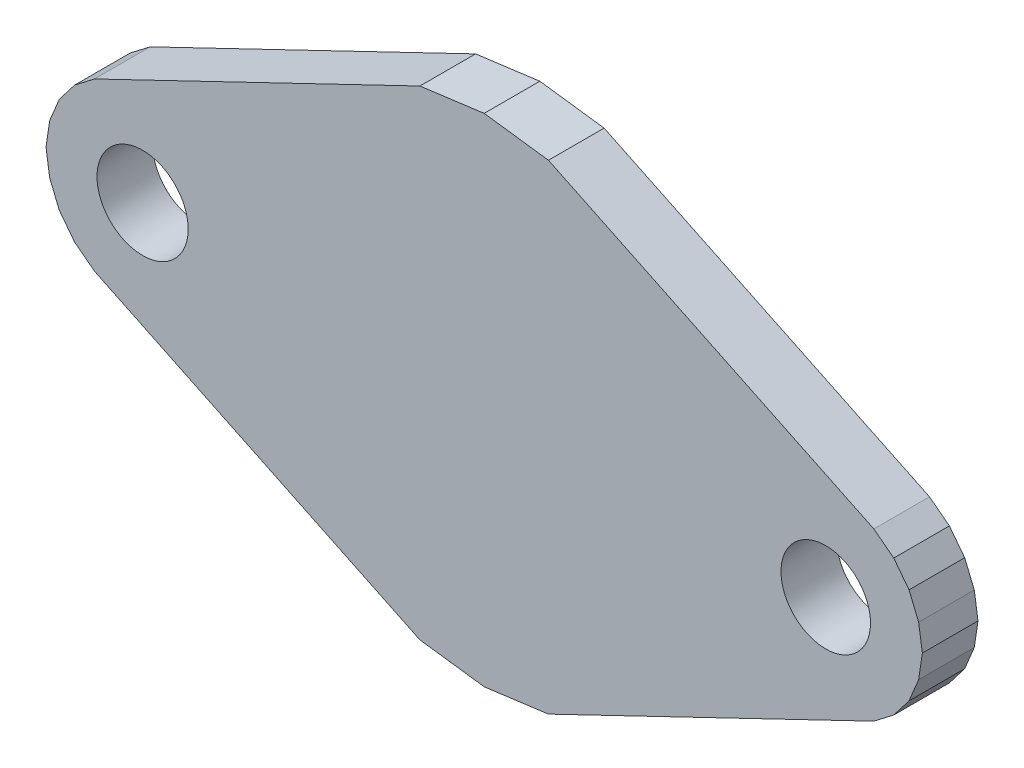
ISO-10303-21;
HEADER;
FILE_DESCRIPTION(('STEP AP214'),'2;1');
FILE_NAME('part.step','',(''),(''),'','','');
FILE_SCHEMA(('AUTOMOTIVE_DESIGN { 1 0 10303 214 1 1 1 1 }'));
ENDSEC;
DATA;
#1=APPLICATION_CONTEXT('core data for automotive mechanical design processes');
#2=APPLICATION_PROTOCOL_DEFINITION('international standard','automotive_design',2000,#1);
#3=PRODUCT_CONTEXT('',#1,'mechanical');
#4=PRODUCT('Part','Part','',(#3));
#5=PRODUCT_RELATED_PRODUCT_CATEGORY('part','',(#4));
#6=PRODUCT_DEFINITION_FORMATION('','',#4);
#7=PRODUCT_DEFINITION_CONTEXT('part definition',#1,'design');
#8=PRODUCT_DEFINITION('design','',#6,#7);
#9=PRODUCT_DEFINITION_SHAPE('','',#8);
#10=(LENGTH_UNIT() NAMED_UNIT(*) SI_UNIT(.MILLI.,.METRE.));
#11=(NAMED_UNIT(*) PLANE_ANGLE_UNIT() SI_UNIT($,.RADIAN.));
#12=(NAMED_UNIT(*) SI_UNIT($,.STERADIAN.) SOLID_ANGLE_UNIT());
#13=UNCERTAINTY_MEASURE_WITH_UNIT(LENGTH_MEASURE(1.E-05),#10,'distance_accuracy_value','');
#14=(GEOMETRIC_REPRESENTATION_CONTEXT(3) GLOBAL_UNCERTAINTY_ASSIGNED_CONTEXT((#13)) GLOBAL_UNIT_ASSIGNED_CONTEXT((#10,
#11,#12)) REPRESENTATION_CONTEXT('',''));
#15=CARTESIAN_POINT('',(0.,0.,0.));
#16=DIRECTION('',(0.,0.,1.));
#17=DIRECTION('',(1.,0.,0.));
#18=AXIS2_PLACEMENT_3D('',#15,#16,#17);
#19=CARTESIAN_POINT('',(-0.726920364105193,5.52151047865007,3.));
#20=DIRECTION('',(-0.130526142647191,0.9914448679002,0.));
#21=DIRECTION('',(-0.9914448679002,-0.130526142647191,0.));
#22=AXIS2_PLACEMENT_3D('',#19,#20,#21);
#23=PLANE('',#22);
#24=DIRECTION('',(0.9914448679002,0.130526142647191,0.));
#25=VECTOR('',#24,1.);
#26=CARTESIAN_POINT('',(-0.726920364105193,5.52151047865007,0.));
#27=LINE('',#26,#25);
#28=CARTESIAN_POINT('',(-3.44087929403345,5.16421114522703,0.));
#29=VERTEX_POINT('',#28);
#30=CARTESIAN_POINT('',(0.0236220005899665,5.62032121732931,0.));
#31=VERTEX_POINT('',#30);
#32=EDGE_CURVE('E246',#29,#31,#27,.T.);
#33=ORIENTED_EDGE('',*,*,#32,.F.);
#34=DIRECTION('',(0.,0.,-1.));
#35=VECTOR('',#34,1.);
#36=CARTESIAN_POINT('',(-3.44087929403345,5.16421114522703,3.));
#37=LINE('',#36,#35);
#38=CARTESIAN_POINT('',(-3.44087929403345,5.16421114522703,3.));
#39=VERTEX_POINT('',#38);
#40=EDGE_CURVE('E11',#39,#29,#37,.T.);
#41=ORIENTED_EDGE('',*,*,#40,.F.);
#42=DIRECTION('',(0.9914448679002,0.130526142647191,0.));
#43=VECTOR('',#42,1.);
#44=CARTESIAN_POINT('',(-0.726920364105193,5.52151047865007,3.));
#45=LINE('',#44,#43);
#46=CARTESIAN_POINT('',(0.0236220005899665,5.62032121732931,3.));
#47=VERTEX_POINT('',#46);
#48=EDGE_CURVE('E527',#39,#47,#45,.T.);
#49=ORIENTED_EDGE('',*,*,#48,.T.);
#50=DIRECTION('',(0.,0.,-1.));
#51=VECTOR('',#50,1.);
#52=CARTESIAN_POINT('',(0.0236220005899665,5.62032121732931,3.));
#53=LINE('',#52,#51);
#54=EDGE_CURVE('E59',#47,#31,#53,.T.);
#55=ORIENTED_EDGE('',*,*,#54,.T.);
#56=EDGE_LOOP('',(#33,#41,#49,#55));
#57=FACE_BOUND('',#56,.T.);
#58=ADVANCED_FACE('F41',(#57),#23,.T.);
#59=CARTESIAN_POINT('',(-2.66467167889706,5.53771170962161,3.));
#60=DIRECTION('',(0.433599763460749,-0.901105568247574,0.));
#61=DIRECTION('',(0.901105568247574,0.433599763460749,0.));
#62=AXIS2_PLACEMENT_3D('',#59,#60,#61);
#63=PLANE('',#62);
#64=DIRECTION('',(-0.901105568247574,-0.433599763460749,0.));
#65=VECTOR('',#64,1.);
#66=CARTESIAN_POINT('',(-2.66467167889706,5.53771170962161,0.));
#67=LINE('',#66,#65);
#68=CARTESIAN_POINT('',(-20.9829270094633,-3.27678401455183,0.));
#69=VERTEX_POINT('',#68);
#70=EDGE_CURVE('E249',#29,#69,#67,.T.);
#71=ORIENTED_EDGE('',*,*,#70,.T.);
#72=DIRECTION('',(0.,0.,-1.));
#73=VECTOR('',#72,1.);
#74=CARTESIAN_POINT('',(-20.9829270094633,-3.27678401455183,3.));
#75=LINE('',#74,#73);
#76=CARTESIAN_POINT('',(-20.9829270094633,-3.27678401455183,3.));
#77=VERTEX_POINT('',#76);
#78=EDGE_CURVE('E51',#77,#69,#75,.T.);
#79=ORIENTED_EDGE('',*,*,#78,.F.);
#80=DIRECTION('',(-0.901105568247574,-0.433599763460749,0.));
#81=VECTOR('',#80,1.);
#82=CARTESIAN_POINT('',(-2.66467167889706,5.53771170962161,3.));
#83=LINE('',#82,#81);
#84=EDGE_CURVE('E530',#39,#77,#83,.T.);
#85=ORIENTED_EDGE('',*,*,#84,.F.);
#86=ORIENTED_EDGE('',*,*,#40,.T.);
#87=EDGE_LOOP('',(#71,#79,#85,#86));
#88=FACE_BOUND('',#87,.T.);
#89=ADVANCED_FACE('F421',(#88),#63,.F.);
#90=CARTESIAN_POINT('',(-6.19351671958089,8.07154044731068,3.));
#91=DIRECTION('',(0.60876179399814,-0.79335306022487,0.));
#92=DIRECTION('',(0.79335306022487,0.60876179399814,0.));
#93=AXIS2_PLACEMENT_3D('',#90,#91,#92);
#94=PLANE('',#93);
#95=DIRECTION('',(-0.79335306022487,-0.60876179399814,0.));
#96=VECTOR('',#95,1.);
#97=CARTESIAN_POINT('',(-6.19351671958089,8.07154044731068,0.));
#98=LINE('',#97,#96);
#99=CARTESIAN_POINT('',(-22.0563816325739,-4.10047550186415,0.));
#100=VERTEX_POINT('',#99);
#101=EDGE_CURVE('E253',#69,#100,#98,.T.);
#102=ORIENTED_EDGE('',*,*,#101,.T.);
#103=DIRECTION('',(0.,0.,-1.));
#104=VECTOR('',#103,1.);
#105=CARTESIAN_POINT('',(-22.0563816325739,-4.10047550186415,3.));
#106=LINE('',#105,#104);
#107=CARTESIAN_POINT('',(-22.0563816325739,-4.10047550186415,3.));
#108=VERTEX_POINT('',#107);
#109=EDGE_CURVE('E407',#108,#100,#106,.T.);
#110=ORIENTED_EDGE('',*,*,#109,.F.);
#111=DIRECTION('',(-0.79335306022487,-0.60876179399814,0.));
#112=VECTOR('',#111,1.);
#113=CARTESIAN_POINT('',(-6.19351671958089,8.07154044731068,3.));
#114=LINE('',#113,#112);
#115=EDGE_CURVE('E417',#77,#108,#114,.T.);
#116=ORIENTED_EDGE('',*,*,#115,.F.);
#117=ORIENTED_EDGE('',*,*,#78,.T.);
#118=EDGE_LOOP('',(#102,#110,#116,#117));
#119=FACE_BOUND('',#118,.T.);
#120=ADVANCED_FACE('F414',(#119),#94,.F.);
#121=CARTESIAN_POINT('',(-11.9021104194484,9.13281782627906,3.));
#122=DIRECTION('',(0.793353105686463,-0.60876173475149,0.));
#123=DIRECTION('',(0.60876173475149,0.793353105686463,0.));
#124=AXIS2_PLACEMENT_3D('',#121,#122,#123);
#125=PLANE('',#124);
#126=DIRECTION('',(-0.60876173475149,-0.793353105686463,0.));
#127=VECTOR('',#126,1.);
#128=CARTESIAN_POINT('',(-11.9021104194484,9.13281782627906,0.));
#129=LINE('',#128,#127);
#130=CARTESIAN_POINT('',(-22.8800721885636,-5.17392907723684,0.));
#131=VERTEX_POINT('',#130);
#132=EDGE_CURVE('E257',#100,#131,#129,.T.);
#133=ORIENTED_EDGE('',*,*,#132,.T.);
#134=DIRECTION('',(0.,0.,-1.));
#135=VECTOR('',#134,1.);
#136=CARTESIAN_POINT('',(-22.8800721885636,-5.17392907723684,3.));
#137=LINE('',#136,#135);
#138=CARTESIAN_POINT('',(-22.8800721885636,-5.17392907723684,3.));
#139=VERTEX_POINT('',#138);
#140=EDGE_CURVE('E403',#139,#131,#137,.T.);
#141=ORIENTED_EDGE('',*,*,#140,.F.);
#142=DIRECTION('',(-0.60876173475149,-0.793353105686463,0.));
#143=VECTOR('',#142,1.);
#144=CARTESIAN_POINT('',(-11.9021104194484,9.13281782627906,3.));
#145=LINE('',#144,#143);
#146=EDGE_CURVE('E537',#108,#139,#145,.T.);
#147=ORIENTED_EDGE('',*,*,#146,.F.);
#148=ORIENTED_EDGE('',*,*,#109,.T.);
#149=EDGE_LOOP('',(#133,#141,#147,#148));
#150=FACE_BOUND('',#149,.T.);
#151=ADVANCED_FACE('F433',(#150),#125,.F.);
#152=CARTESIAN_POINT('',(-17.7001064420641,7.33162057234155,3.));
#153=DIRECTION('',(0.923879598418656,-0.382683273250586,0.));
#154=DIRECTION('',(0.382683273250586,0.923879598418656,0.));
#155=AXIS2_PLACEMENT_3D('',#152,#153,#154);
#156=PLANE('',#155);
#157=DIRECTION('',(-0.382683273250586,-0.923879598418657,0.));
#158=VECTOR('',#157,1.);
#159=CARTESIAN_POINT('',(-17.7001064420641,7.33162057234155,0.));
#160=LINE('',#159,#158);
#161=CARTESIAN_POINT('',(-23.3978657849366,-6.42399400904675,0.));
#162=VERTEX_POINT('',#161);
#163=EDGE_CURVE('E261',#131,#162,#160,.T.);
#164=ORIENTED_EDGE('',*,*,#163,.T.);
#165=DIRECTION('',(0.,0.,-1.));
#166=VECTOR('',#165,1.);
#167=CARTESIAN_POINT('',(-23.3978657849366,-6.42399400904675,3.));
#168=LINE('',#167,#166);
#169=CARTESIAN_POINT('',(-23.3978657849366,-6.42399400904675,3.));
#170=VERTEX_POINT('',#169);
#171=EDGE_CURVE('E399',#170,#162,#168,.T.);
#172=ORIENTED_EDGE('',*,*,#171,.F.);
#173=DIRECTION('',(-0.382683273250586,-0.923879598418657,0.));
#174=VECTOR('',#173,1.);
#175=CARTESIAN_POINT('',(-17.7001064420641,7.33162057234155,3.));
#176=LINE('',#175,#174);
#177=EDGE_CURVE('E541',#139,#170,#176,.T.);
#178=ORIENTED_EDGE('',*,*,#177,.F.);
#179=ORIENTED_EDGE('',*,*,#140,.T.);
#180=EDGE_LOOP('',(#164,#172,#178,#179));
#181=FACE_BOUND('',#180,.T.);
#182=ADVANCED_FACE('F436',(#181),#156,.F.);
#183=CARTESIAN_POINT('',(-21.9473291319936,3.28048557899017,3.));
#184=DIRECTION('',(0.989012995845742,-0.14782859685538,0.));
#185=DIRECTION('',(0.14782859685538,0.989012995845742,0.));
#186=AXIS2_PLACEMENT_3D('',#183,#184,#185);
#187=PLANE('',#186);
#188=DIRECTION('',(-0.14782859685538,-0.989012995845742,0.));
#189=VECTOR('',#188,1.);
#190=CARTESIAN_POINT('',(-21.9473291319936,3.28048557899017,0.));
#191=LINE('',#190,#189);
#192=CARTESIAN_POINT('',(-23.5983785893768,-7.76547849610348,0.));
#193=VERTEX_POINT('',#192);
#194=EDGE_CURVE('E265',#162,#193,#191,.T.);
#195=ORIENTED_EDGE('',*,*,#194,.T.);
#196=DIRECTION('',(0.,0.,-1.));
#197=VECTOR('',#196,1.);
#198=CARTESIAN_POINT('',(-23.5983785893768,-7.76547849610348,3.));
#199=LINE('',#198,#197);
#200=CARTESIAN_POINT('',(-23.5983785893768,-7.76547849610348,3.));
#201=VERTEX_POINT('',#200);
#202=EDGE_CURVE('E395',#201,#193,#199,.T.);
#203=ORIENTED_EDGE('',*,*,#202,.F.);
#204=DIRECTION('',(-0.14782859685538,-0.989012995845742,0.));
#205=VECTOR('',#204,1.);
#206=CARTESIAN_POINT('',(-21.9473291319936,3.28048557899017,3.));
#207=LINE('',#206,#205);
#208=EDGE_CURVE('E545',#170,#201,#207,.T.);
#209=ORIENTED_EDGE('',*,*,#208,.F.);
#210=ORIENTED_EDGE('',*,*,#171,.T.);
#211=EDGE_LOOP('',(#195,#203,#209,#210));
#212=FACE_BOUND('',#211,.T.);
#213=ADVANCED_FACE('F440',(#212),#187,.F.);
#214=CARTESIAN_POINT('',(-24.2180234873694,-3.61989067006792,3.));
#215=DIRECTION('',(0.989012980840817,0.147828697242321,0.));
#216=DIRECTION('',(-0.147828697242321,0.989012980840817,0.));
#217=AXIS2_PLACEMENT_3D('',#214,#215,#216);
#218=PLANE('',#217);
#219=DIRECTION('',(0.147828697242321,-0.989012980840817,0.));
#220=VECTOR('',#219,1.);
#221=CARTESIAN_POINT('',(-24.2180234873694,-3.61989067006792,0.));
#222=LINE('',#221,#220);
#223=CARTESIAN_POINT('',(-23.3978657849366,-9.10696205183764,0.));
#224=VERTEX_POINT('',#223);
#225=EDGE_CURVE('E269',#193,#224,#222,.T.);
#226=ORIENTED_EDGE('',*,*,#225,.T.);
#227=DIRECTION('',(0.,0.,-1.));
#228=VECTOR('',#227,1.);
#229=CARTESIAN_POINT('',(-23.3978657849366,-9.10696205183764,3.));
#230=LINE('',#229,#228);
#231=CARTESIAN_POINT('',(-23.3978657849366,-9.10696205183764,3.));
#232=VERTEX_POINT('',#231);
#233=EDGE_CURVE('E391',#232,#224,#230,.T.);
#234=ORIENTED_EDGE('',*,*,#233,.F.);
#235=DIRECTION('',(0.147828697242321,-0.989012980840817,0.));
#236=VECTOR('',#235,1.);
#237=CARTESIAN_POINT('',(-24.2180234873694,-3.61989067006792,3.));
#238=LINE('',#237,#236);
#239=EDGE_CURVE('E549',#201,#232,#238,.T.);
#240=ORIENTED_EDGE('',*,*,#239,.F.);
#241=ORIENTED_EDGE('',*,*,#202,.T.);
#242=EDGE_LOOP('',(#226,#234,#240,#241));
#243=FACE_BOUND('',#242,.T.);
#244=ADVANCED_FACE('F444',(#243),#218,.F.);
#245=CARTESIAN_POINT('',(-23.1911267251698,-9.60607453692842,3.));
#246=DIRECTION('',(0.923879598418656,0.382683273250586,0.));
#247=DIRECTION('',(-0.382683273250586,0.923879598418656,0.));
#248=AXIS2_PLACEMENT_3D('',#245,#246,#247);
#249=PLANE('',#248);
#250=DIRECTION('',(0.382683273250586,-0.923879598418657,0.));
#251=VECTOR('',#250,1.);
#252=CARTESIAN_POINT('',(-23.1911267251698,-9.60607453692842,0.));
#253=LINE('',#252,#251);
#254=CARTESIAN_POINT('',(-22.8800721885636,-10.3570269836475,0.));
#255=VERTEX_POINT('',#254);
#256=EDGE_CURVE('E273',#224,#255,#253,.T.);
#257=ORIENTED_EDGE('',*,*,#256,.T.);
#258=DIRECTION('',(0.,0.,-1.));
#259=VECTOR('',#258,1.);
#260=CARTESIAN_POINT('',(-22.8800721885636,-10.3570269836475,3.));
#261=LINE('',#260,#259);
#262=CARTESIAN_POINT('',(-22.8800721885636,-10.3570269836475,3.));
#263=VERTEX_POINT('',#262);
#264=EDGE_CURVE('E388',#263,#255,#261,.T.);
#265=ORIENTED_EDGE('',*,*,#264,.F.);
#266=DIRECTION('',(0.382683273250586,-0.923879598418657,0.));
#267=VECTOR('',#266,1.);
#268=CARTESIAN_POINT('',(-23.1911267251698,-9.60607453692842,3.));
#269=LINE('',#268,#267);
#270=EDGE_CURVE('E553',#232,#263,#269,.T.);
#271=ORIENTED_EDGE('',*,*,#270,.F.);
#272=ORIENTED_EDGE('',*,*,#233,.T.);
#273=EDGE_LOOP('',(#257,#265,#271,#272));
#274=FACE_BOUND('',#273,.T.);
#275=ADVANCED_FACE('F448',(#274),#249,.F.);
#276=CARTESIAN_POINT('',(-19.402995888878,-14.8884413562889,3.));
#277=DIRECTION('',(-0.793353360767237,-0.608761402323875,0.));
#278=DIRECTION('',(0.608761402323875,-0.793353360767237,0.));
#279=AXIS2_PLACEMENT_3D('',#276,#277,#278);
#280=PLANE('',#279);
#281=DIRECTION('',(-0.608761402323875,0.793353360767237,0.));
#282=VECTOR('',#281,1.);
#283=CARTESIAN_POINT('',(-19.402995888878,-14.8884413562889,0.));
#284=LINE('',#283,#282);
#285=CARTESIAN_POINT('',(-22.0563816325739,-11.4304814903428,0.));
#286=VERTEX_POINT('',#285);
#287=EDGE_CURVE('E277',#286,#255,#284,.T.);
#288=ORIENTED_EDGE('',*,*,#287,.F.);
#289=DIRECTION('',(0.,0.,-1.));
#290=VECTOR('',#289,1.);
#291=CARTESIAN_POINT('',(-22.0563816325739,-11.4304814903428,3.));
#292=LINE('',#291,#290);
#293=CARTESIAN_POINT('',(-22.0563816325739,-11.4304814903428,3.));
#294=VERTEX_POINT('',#293);
#295=EDGE_CURVE('E385',#294,#286,#292,.T.);
#296=ORIENTED_EDGE('',*,*,#295,.F.);
#297=DIRECTION('',(-0.608761402323875,0.793353360767237,0.));
#298=VECTOR('',#297,1.);
#299=CARTESIAN_POINT('',(-19.402995888878,-14.8884413562889,3.));
#300=LINE('',#299,#298);
#301=EDGE_CURVE('E556',#294,#263,#300,.T.);
#302=ORIENTED_EDGE('',*,*,#301,.T.);
#303=ORIENTED_EDGE('',*,*,#264,.T.);
#304=EDGE_LOOP('',(#288,#296,#302,#303));
#305=FACE_BOUND('',#304,.T.);
#306=ADVANCED_FACE('F452',(#305),#280,.T.);
#307=CARTESIAN_POINT('',(-13.6943815522854,-17.8468686827146,3.));
#308=DIRECTION('',(0.608761360770441,0.793353392652304,0.));
#309=DIRECTION('',(-0.793353392652304,0.608761360770441,0.));
#310=AXIS2_PLACEMENT_3D('',#307,#308,#309);
#311=PLANE('',#310);
#312=DIRECTION('',(0.793353392652304,-0.608761360770441,0.));
#313=VECTOR('',#312,1.);
#314=CARTESIAN_POINT('',(-13.6943815522854,-17.8468686827146,0.));
#315=LINE('',#314,#313);
#316=CARTESIAN_POINT('',(-20.9829270094633,-12.2541720463326,0.));
#317=VERTEX_POINT('',#316);
#318=EDGE_CURVE('E281',#286,#317,#315,.T.);
#319=ORIENTED_EDGE('',*,*,#318,.T.);
#320=DIRECTION('',(0.,0.,-1.));
#321=VECTOR('',#320,1.);
#322=CARTESIAN_POINT('',(-20.9829270094633,-12.2541720463326,3.));
#323=LINE('',#322,#321);
#324=CARTESIAN_POINT('',(-20.9829270094633,-12.2541720463326,3.));
#325=VERTEX_POINT('',#324);
#326=EDGE_CURVE('E381',#325,#317,#323,.T.);
#327=ORIENTED_EDGE('',*,*,#326,.F.);
#328=DIRECTION('',(0.793353392652304,-0.608761360770441,0.));
#329=VECTOR('',#328,1.);
#330=CARTESIAN_POINT('',(-13.6943815522854,-17.8468686827146,3.));
#331=LINE('',#330,#329);
#332=EDGE_CURVE('E560',#294,#325,#331,.T.);
#333=ORIENTED_EDGE('',*,*,#332,.F.);
#334=ORIENTED_EDGE('',*,*,#295,.T.);
#335=EDGE_LOOP('',(#319,#327,#333,#334));
#336=FACE_BOUND('',#335,.T.);
#337=ADVANCED_FACE('F456',(#336),#311,.F.);
#338=CARTESIAN_POINT('',(-8.7329148628085,-18.148712214343,3.));
#339=DIRECTION('',(0.433599803130449,0.901105549159051,0.));
#340=DIRECTION('',(-0.901105549159052,0.433599803130449,0.));
#341=AXIS2_PLACEMENT_3D('',#338,#339,#340);
#342=PLANE('',#341);
#343=DIRECTION('',(0.901105549159052,-0.433599803130449,0.));
#344=VECTOR('',#343,1.);
#345=CARTESIAN_POINT('',(-8.7329148628085,-18.148712214343,0.));
#346=LINE('',#345,#344);
#347=CARTESIAN_POINT('',(-3.44087935052812,-20.6951681299963,0.));
#348=VERTEX_POINT('',#347);
#349=EDGE_CURVE('E285',#317,#348,#346,.T.);
#350=ORIENTED_EDGE('',*,*,#349,.T.);
#351=DIRECTION('',(0.,0.,-1.));
#352=VECTOR('',#351,1.);
#353=CARTESIAN_POINT('',(-3.44087935052812,-20.6951681299963,3.));
#354=LINE('',#353,#352);
#355=CARTESIAN_POINT('',(-3.44087935052812,-20.6951681299963,3.));
#356=VERTEX_POINT('',#355);
#357=EDGE_CURVE('E377',#356,#348,#354,.T.);
#358=ORIENTED_EDGE('',*,*,#357,.F.);
#359=DIRECTION('',(0.901105549159052,-0.433599803130449,0.));
#360=VECTOR('',#359,1.);
#361=CARTESIAN_POINT('',(-8.7329148628085,-18.148712214343,3.));
#362=LINE('',#361,#360);
#363=EDGE_CURVE('E564',#325,#356,#362,.T.);
#364=ORIENTED_EDGE('',*,*,#363,.F.);
#365=ORIENTED_EDGE('',*,*,#326,.T.);
#366=EDGE_LOOP('',(#350,#358,#364,#365));
#367=FACE_BOUND('',#366,.T.);
#368=ADVANCED_FACE('F460',(#367),#342,.F.);
#369=CARTESIAN_POINT('',(-2.73677334313388,-20.7878654086201,3.));
#370=DIRECTION('',(0.130526142647191,0.9914448679002,0.));
#371=DIRECTION('',(-0.9914448679002,0.130526142647191,0.));
#372=AXIS2_PLACEMENT_3D('',#369,#370,#371);
#373=PLANE('',#372);
#374=DIRECTION('',(0.9914448679002,-0.130526142647191,0.));
#375=VECTOR('',#374,1.);
#376=CARTESIAN_POINT('',(-2.73677334313388,-20.7878654086201,0.));
#377=LINE('',#376,#375);
#378=CARTESIAN_POINT('',(0.0236220005899665,-21.1512782095363,0.));
#379=VERTEX_POINT('',#378);
#380=EDGE_CURVE('E289',#348,#379,#377,.T.);
#381=ORIENTED_EDGE('',*,*,#380,.T.);
#382=DIRECTION('',(0.,0.,-1.));
#383=VECTOR('',#382,1.);
#384=CARTESIAN_POINT('',(0.0236220005899665,-21.1512782095363,3.));
#385=LINE('',#384,#383);
#386=CARTESIAN_POINT('',(0.0236220005899665,-21.1512782095363,3.));
#387=VERTEX_POINT('',#386);
#388=EDGE_CURVE('E373',#387,#379,#385,.T.);
#389=ORIENTED_EDGE('',*,*,#388,.F.);
#390=DIRECTION('',(0.9914448679002,-0.130526142647191,0.));
#391=VECTOR('',#390,1.);
#392=CARTESIAN_POINT('',(-2.73677334313388,-20.7878654086201,3.));
#393=LINE('',#392,#391);
#394=EDGE_CURVE('E568',#356,#387,#393,.T.);
#395=ORIENTED_EDGE('',*,*,#394,.F.);
#396=ORIENTED_EDGE('',*,*,#357,.T.);
#397=EDGE_LOOP('',(#381,#389,#395,#396));
#398=FACE_BOUND('',#397,.T.);
#399=ADVANCED_FACE('F464',(#398),#373,.F.);
#400=CARTESIAN_POINT('',(2.73757824267399,-20.7939792299745,3.));
#401=DIRECTION('',(-0.130526142647191,0.9914448679002,0.));
#402=DIRECTION('',(-0.9914448679002,-0.130526142647191,0.));
#403=AXIS2_PLACEMENT_3D('',#400,#401,#402);
#404=PLANE('',#403);
#405=DIRECTION('',(0.9914448679002,0.130526142647191,0.));
#406=VECTOR('',#405,1.);
#407=CARTESIAN_POINT('',(2.73757824267399,-20.7939792299745,0.));
#408=LINE('',#407,#406);
#409=CARTESIAN_POINT('',(3.48812335170805,-20.6951681299963,0.));
#410=VERTEX_POINT('',#409);
#411=EDGE_CURVE('E293',#379,#410,#408,.T.);
#412=ORIENTED_EDGE('',*,*,#411,.T.);
#413=DIRECTION('',(0.,0.,-1.));
#414=VECTOR('',#413,1.);
#415=CARTESIAN_POINT('',(3.48812335170805,-20.6951681299963,3.));
#416=LINE('',#415,#414);
#417=CARTESIAN_POINT('',(3.48812335170805,-20.6951681299963,3.));
#418=VERTEX_POINT('',#417);
#419=EDGE_CURVE('E370',#418,#410,#416,.T.);
#420=ORIENTED_EDGE('',*,*,#419,.F.);
#421=DIRECTION('',(0.9914448679002,0.130526142647191,0.));
#422=VECTOR('',#421,1.);
#423=CARTESIAN_POINT('',(2.73757824267399,-20.7939792299745,3.));
#424=LINE('',#423,#422);
#425=EDGE_CURVE('E572',#387,#418,#424,.T.);
#426=ORIENTED_EDGE('',*,*,#425,.F.);
#427=ORIENTED_EDGE('',*,*,#388,.T.);
#428=EDGE_LOOP('',(#412,#420,#426,#427));
#429=FACE_BOUND('',#428,.T.);
#430=ADVANCED_FACE('F468',(#429),#404,.F.);
#431=CARTESIAN_POINT('',(8.74179715027083,-18.1671713521557,3.));
#432=DIRECTION('',(0.433599803130449,-0.901105549159052,0.));
#433=DIRECTION('',(0.901105549159052,0.433599803130449,0.));
#434=AXIS2_PLACEMENT_3D('',#431,#432,#433);
#435=PLANE('',#434);
#436=DIRECTION('',(-0.901105549159052,-0.433599803130449,0.));
#437=VECTOR('',#436,1.);
#438=CARTESIAN_POINT('',(8.74179715027083,-18.1671713521557,0.));
#439=LINE('',#438,#437);
#440=CARTESIAN_POINT('',(21.0301710106433,-12.2541720463326,0.));
#441=VERTEX_POINT('',#440);
#442=EDGE_CURVE('E297',#441,#410,#439,.T.);
#443=ORIENTED_EDGE('',*,*,#442,.F.);
#444=DIRECTION('',(0.,0.,-1.));
#445=VECTOR('',#444,1.);
#446=CARTESIAN_POINT('',(21.0301710106433,-12.2541720463326,3.));
#447=LINE('',#446,#445);
#448=CARTESIAN_POINT('',(21.0301710106433,-12.2541720463326,3.));
#449=VERTEX_POINT('',#448);
#450=EDGE_CURVE('E367',#449,#441,#447,.T.);
#451=ORIENTED_EDGE('',*,*,#450,.F.);
#452=DIRECTION('',(-0.901105549159052,-0.433599803130449,0.));
#453=VECTOR('',#452,1.);
#454=CARTESIAN_POINT('',(8.74179715027083,-18.1671713521557,3.));
#455=LINE('',#454,#453);
#456=EDGE_CURVE('E575',#449,#418,#455,.T.);
#457=ORIENTED_EDGE('',*,*,#456,.T.);
#458=ORIENTED_EDGE('',*,*,#419,.T.);
#459=EDGE_LOOP('',(#443,#451,#457,#458));
#460=FACE_BOUND('',#459,.T.);
#461=ADVANCED_FACE('F472',(#460),#435,.T.);
#462=CARTESIAN_POINT('',(13.7118897253142,-17.8696857821014,3.));
#463=DIRECTION('',(0.608761360770443,-0.793353392652302,0.));
#464=DIRECTION('',(0.793353392652302,0.608761360770443,0.));
#465=AXIS2_PLACEMENT_3D('',#462,#463,#464);
#466=PLANE('',#465);
#467=DIRECTION('',(-0.793353392652303,-0.608761360770443,0.));
#468=VECTOR('',#467,1.);
#469=CARTESIAN_POINT('',(13.7118897253142,-17.8696857821014,0.));
#470=LINE('',#469,#468);
#471=CARTESIAN_POINT('',(22.1036256337538,-11.4304814903428,0.));
#472=VERTEX_POINT('',#471);
#473=EDGE_CURVE('E301',#472,#441,#470,.T.);
#474=ORIENTED_EDGE('',*,*,#473,.F.);
#475=DIRECTION('',(0.,0.,-1.));
#476=VECTOR('',#475,1.);
#477=CARTESIAN_POINT('',(22.1036256337538,-11.4304814903428,3.));
#478=LINE('',#477,#476);
#479=CARTESIAN_POINT('',(22.1036256337538,-11.4304814903428,3.));
#480=VERTEX_POINT('',#479);
#481=EDGE_CURVE('E364',#480,#472,#478,.T.);
#482=ORIENTED_EDGE('',*,*,#481,.F.);
#483=DIRECTION('',(-0.793353392652303,-0.608761360770443,0.));
#484=VECTOR('',#483,1.);
#485=CARTESIAN_POINT('',(13.7118897253142,-17.8696857821014,3.));
#486=LINE('',#485,#484);
#487=EDGE_CURVE('E579',#480,#449,#486,.T.);
#488=ORIENTED_EDGE('',*,*,#487,.T.);
#489=ORIENTED_EDGE('',*,*,#450,.T.);
#490=EDGE_LOOP('',(#474,#482,#488,#489));
#491=FACE_BOUND('',#490,.T.);
#492=ADVANCED_FACE('F476',(#491),#466,.T.);
#493=CARTESIAN_POINT('',(19.4327317146389,-14.9112584563162,3.));
#494=DIRECTION('',(-0.793353360767235,0.608761402323878,0.));
#495=DIRECTION('',(-0.608761402323878,-0.793353360767235,0.));
#496=AXIS2_PLACEMENT_3D('',#493,#494,#495);
#497=PLANE('',#496);
#498=DIRECTION('',(0.608761402323878,0.793353360767235,0.));
#499=VECTOR('',#498,1.);
#500=CARTESIAN_POINT('',(19.4327317146389,-14.9112584563162,0.));
#501=LINE('',#500,#499);
#502=CARTESIAN_POINT('',(22.9273161897436,-10.3570269836475,0.));
#503=VERTEX_POINT('',#502);
#504=EDGE_CURVE('E305',#472,#503,#501,.T.);
#505=ORIENTED_EDGE('',*,*,#504,.T.);
#506=DIRECTION('',(0.,0.,-1.));
#507=VECTOR('',#506,1.);
#508=CARTESIAN_POINT('',(22.9273161897436,-10.3570269836475,3.));
#509=LINE('',#508,#507);
#510=CARTESIAN_POINT('',(22.9273161897436,-10.3570269836475,3.));
#511=VERTEX_POINT('',#510);
#512=EDGE_CURVE('E361',#511,#503,#509,.T.);
#513=ORIENTED_EDGE('',*,*,#512,.F.);
#514=DIRECTION('',(0.608761402323878,0.793353360767235,0.));
#515=VECTOR('',#514,1.);
#516=CARTESIAN_POINT('',(19.4327317146389,-14.9112584563162,3.));
#517=LINE('',#516,#515);
#518=EDGE_CURVE('E583',#480,#511,#517,.T.);
#519=ORIENTED_EDGE('',*,*,#518,.F.);
#520=ORIENTED_EDGE('',*,*,#481,.T.);
#521=EDGE_LOOP('',(#505,#513,#519,#520));
#522=FACE_BOUND('',#521,.T.);
#523=ADVANCED_FACE('F480',(#522),#497,.F.);
#524=CARTESIAN_POINT('',(23.2314520083156,-9.62277780797725,3.));
#525=DIRECTION('',(0.923879598418658,-0.382683273250581,0.));
#526=DIRECTION('',(0.382683273250581,0.923879598418658,0.));
#527=AXIS2_PLACEMENT_3D('',#524,#525,#526);
#528=PLANE('',#527);
#529=DIRECTION('',(-0.382683273250581,-0.923879598418658,0.));
#530=VECTOR('',#529,1.);
#531=CARTESIAN_POINT('',(23.2314520083156,-9.62277780797725,0.));
#532=LINE('',#531,#530);
#533=CARTESIAN_POINT('',(23.4451097861165,-9.10696205183764,0.));
#534=VERTEX_POINT('',#533);
#535=EDGE_CURVE('E309',#534,#503,#532,.T.);
#536=ORIENTED_EDGE('',*,*,#535,.F.);
#537=DIRECTION('',(0.,0.,-1.));
#538=VECTOR('',#537,1.);
#539=CARTESIAN_POINT('',(23.4451097861165,-9.10696205183764,3.));
#540=LINE('',#539,#538);
#541=CARTESIAN_POINT('',(23.4451097861165,-9.10696205183764,3.));
#542=VERTEX_POINT('',#541);
#543=EDGE_CURVE('E358',#542,#534,#540,.T.);
#544=ORIENTED_EDGE('',*,*,#543,.F.);
#545=DIRECTION('',(-0.382683273250581,-0.923879598418658,0.));
#546=VECTOR('',#545,1.);
#547=CARTESIAN_POINT('',(23.2314520083156,-9.62277780797725,3.));
#548=LINE('',#547,#546);
#549=EDGE_CURVE('E586',#542,#511,#548,.T.);
#550=ORIENTED_EDGE('',*,*,#549,.T.);
#551=ORIENTED_EDGE('',*,*,#512,.T.);
#552=EDGE_LOOP('',(#536,#544,#550,#551));
#553=FACE_BOUND('',#552,.T.);
#554=ADVANCED_FACE('F484',(#553),#528,.T.);
#555=CARTESIAN_POINT('',(24.2642350500973,-3.62679795566269,3.));
#556=DIRECTION('',(0.989012980840817,-0.147828697242321,0.));
#557=DIRECTION('',(0.147828697242321,0.989012980840817,0.));
#558=AXIS2_PLACEMENT_3D('',#555,#556,#557);
#559=PLANE('',#558);
#560=DIRECTION('',(-0.147828697242321,-0.989012980840817,0.));
#561=VECTOR('',#560,1.);
#562=CARTESIAN_POINT('',(24.2642350500973,-3.62679795566269,0.));
#563=LINE('',#562,#561);
#564=CARTESIAN_POINT('',(23.6456225905567,-7.76547849610348,0.));
#565=VERTEX_POINT('',#564);
#566=EDGE_CURVE('E313',#565,#534,#563,.T.);
#567=ORIENTED_EDGE('',*,*,#566,.F.);
#568=DIRECTION('',(0.,0.,-1.));
#569=VECTOR('',#568,1.);
#570=CARTESIAN_POINT('',(23.6456225905567,-7.76547849610348,3.));
#571=LINE('',#570,#569);
#572=CARTESIAN_POINT('',(23.6456225905567,-7.76547849610348,3.));
#573=VERTEX_POINT('',#572);
#574=EDGE_CURVE('E355',#573,#565,#571,.T.);
#575=ORIENTED_EDGE('',*,*,#574,.F.);
#576=DIRECTION('',(-0.147828697242321,-0.989012980840817,0.));
#577=VECTOR('',#576,1.);
#578=CARTESIAN_POINT('',(24.2642350500973,-3.62679795566269,3.));
#579=LINE('',#578,#577);
#580=EDGE_CURVE('E590',#573,#542,#579,.T.);
#581=ORIENTED_EDGE('',*,*,#580,.T.);
#582=ORIENTED_EDGE('',*,*,#543,.T.);
#583=EDGE_LOOP('',(#567,#575,#581,#582));
#584=FACE_BOUND('',#583,.T.);
#585=ADVANCED_FACE('F488',(#584),#559,.T.);
#586=CARTESIAN_POINT('',(21.9935406961238,3.28739285999916,3.));
#587=DIRECTION('',(0.989012995845742,0.14782859685538,0.));
#588=DIRECTION('',(-0.14782859685538,0.989012995845742,0.));
#589=AXIS2_PLACEMENT_3D('',#586,#587,#588);
#590=PLANE('',#589);
#591=DIRECTION('',(0.14782859685538,-0.989012995845742,0.));
#592=VECTOR('',#591,1.);
#593=CARTESIAN_POINT('',(21.9935406961238,3.28739285999916,0.));
#594=LINE('',#593,#592);
#595=CARTESIAN_POINT('',(23.4451097861165,-6.42399400904675,0.));
#596=VERTEX_POINT('',#595);
#597=EDGE_CURVE('E317',#596,#565,#594,.T.);
#598=ORIENTED_EDGE('',*,*,#597,.F.);
#599=DIRECTION('',(0.,0.,-1.));
#600=VECTOR('',#599,1.);
#601=CARTESIAN_POINT('',(23.4451097861165,-6.42399400904675,3.));
#602=LINE('',#601,#600);
#603=CARTESIAN_POINT('',(23.4451097861165,-6.42399400904675,3.));
#604=VERTEX_POINT('',#603);
#605=EDGE_CURVE('E352',#604,#596,#602,.T.);
#606=ORIENTED_EDGE('',*,*,#605,.F.);
#607=DIRECTION('',(0.14782859685538,-0.989012995845742,0.));
#608=VECTOR('',#607,1.);
#609=CARTESIAN_POINT('',(21.9935406961238,3.28739285999916,3.));
#610=LINE('',#609,#608);
#611=EDGE_CURVE('E594',#604,#573,#610,.T.);
#612=ORIENTED_EDGE('',*,*,#611,.T.);
#613=ORIENTED_EDGE('',*,*,#574,.T.);
#614=EDGE_LOOP('',(#598,#606,#612,#613));
#615=FACE_BOUND('',#614,.T.);
#616=ADVANCED_FACE('F492',(#615),#590,.T.);
#617=CARTESIAN_POINT('',(17.74043172521,7.34832384339043,3.));
#618=DIRECTION('',(0.923879598418658,0.382683273250581,0.));
#619=DIRECTION('',(-0.382683273250581,0.923879598418658,0.));
#620=AXIS2_PLACEMENT_3D('',#617,#618,#619);
#621=PLANE('',#620);
#622=DIRECTION('',(0.382683273250581,-0.923879598418658,0.));
#623=VECTOR('',#622,1.);
#624=CARTESIAN_POINT('',(17.74043172521,7.34832384339043,0.));
#625=LINE('',#624,#623);
#626=CARTESIAN_POINT('',(22.9273161897436,-5.17392907723685,0.));
#627=VERTEX_POINT('',#626);
#628=EDGE_CURVE('E321',#627,#596,#625,.T.);
#629=ORIENTED_EDGE('',*,*,#628,.F.);
#630=DIRECTION('',(0.,0.,-1.));
#631=VECTOR('',#630,1.);
#632=CARTESIAN_POINT('',(22.9273161897436,-5.17392907723685,3.));
#633=LINE('',#632,#631);
#634=CARTESIAN_POINT('',(22.9273161897436,-5.17392907723685,3.));
#635=VERTEX_POINT('',#634);
#636=EDGE_CURVE('E349',#635,#627,#633,.T.);
#637=ORIENTED_EDGE('',*,*,#636,.F.);
#638=DIRECTION('',(0.382683273250581,-0.923879598418658,0.));
#639=VECTOR('',#638,1.);
#640=CARTESIAN_POINT('',(17.74043172521,7.34832384339043,3.));
#641=LINE('',#640,#639);
#642=EDGE_CURVE('E598',#635,#604,#641,.T.);
#643=ORIENTED_EDGE('',*,*,#642,.T.);
#644=ORIENTED_EDGE('',*,*,#605,.T.);
#645=EDGE_LOOP('',(#629,#637,#643,#644));
#646=FACE_BOUND('',#645,.T.);
#647=ADVANCED_FACE('F496',(#646),#621,.T.);
#648=CARTESIAN_POINT('',(11.9318462260878,9.15563493142982,3.));
#649=DIRECTION('',(0.793353105686461,0.608761734751493,0.));
#650=DIRECTION('',(-0.608761734751493,0.793353105686461,0.));
#651=AXIS2_PLACEMENT_3D('',#648,#649,#650);
#652=PLANE('',#651);
#653=DIRECTION('',(0.608761734751493,-0.793353105686461,0.));
#654=VECTOR('',#653,1.);
#655=CARTESIAN_POINT('',(11.9318462260878,9.15563493142982,0.));
#656=LINE('',#655,#654);
#657=CARTESIAN_POINT('',(22.1036256337538,-4.10047550186415,0.));
#658=VERTEX_POINT('',#657);
#659=EDGE_CURVE('E325',#658,#627,#656,.T.);
#660=ORIENTED_EDGE('',*,*,#659,.F.);
#661=DIRECTION('',(0.,0.,-1.));
#662=VECTOR('',#661,1.);
#663=CARTESIAN_POINT('',(22.1036256337538,-4.10047550186415,3.));
#664=LINE('',#663,#662);
#665=CARTESIAN_POINT('',(22.1036256337538,-4.10047550186415,3.));
#666=VERTEX_POINT('',#665);
#667=EDGE_CURVE('E215',#666,#658,#664,.T.);
#668=ORIENTED_EDGE('',*,*,#667,.F.);
#669=DIRECTION('',(0.608761734751493,-0.793353105686461,0.));
#670=VECTOR('',#669,1.);
#671=CARTESIAN_POINT('',(11.9318462260878,9.15563493142982,3.));
#672=LINE('',#671,#670);
#673=EDGE_CURVE('E227',#666,#635,#672,.T.);
#674=ORIENTED_EDGE('',*,*,#673,.T.);
#675=ORIENTED_EDGE('',*,*,#636,.T.);
#676=EDGE_LOOP('',(#660,#668,#674,#675));
#677=FACE_BOUND('',#676,.T.);
#678=ADVANCED_FACE('F500',(#677),#652,.T.);
#679=CARTESIAN_POINT('',(6.21102491752925,8.0943575533746,3.));
#680=DIRECTION('',(0.608761793998142,0.793353060224868,0.));
#681=DIRECTION('',(-0.793353060224868,0.608761793998142,0.));
#682=AXIS2_PLACEMENT_3D('',#679,#680,#681);
#683=PLANE('',#682);
#684=DIRECTION('',(0.793353060224868,-0.608761793998142,0.));
#685=VECTOR('',#684,1.);
#686=CARTESIAN_POINT('',(6.21102491752925,8.0943575533746,0.));
#687=LINE('',#686,#685);
#688=CARTESIAN_POINT('',(21.0301710106433,-3.27678401455183,0.));
#689=VERTEX_POINT('',#688);
#690=EDGE_CURVE('E210',#689,#658,#687,.T.);
#691=ORIENTED_EDGE('',*,*,#690,.F.);
#692=DIRECTION('',(0.,0.,-1.));
#693=VECTOR('',#692,1.);
#694=CARTESIAN_POINT('',(21.0301710106433,-3.27678401455183,3.));
#695=LINE('',#694,#693);
#696=CARTESIAN_POINT('',(21.0301710106433,-3.27678401455183,3.));
#697=VERTEX_POINT('',#696);
#698=EDGE_CURVE('E205',#697,#689,#695,.T.);
#699=ORIENTED_EDGE('',*,*,#698,.F.);
#700=DIRECTION('',(0.793353060224868,-0.608761793998142,0.));
#701=VECTOR('',#700,1.);
#702=CARTESIAN_POINT('',(6.21102491752925,8.0943575533746,3.));
#703=LINE('',#702,#701);
#704=EDGE_CURVE('E208',#697,#666,#703,.T.);
#705=ORIENTED_EDGE('',*,*,#704,.T.);
#706=ORIENTED_EDGE('',*,*,#667,.T.);
#707=EDGE_LOOP('',(#691,#699,#705,#706));
#708=FACE_BOUND('',#707,.T.);
#709=ADVANCED_FACE('F207',(#708),#683,.T.);
#710=CARTESIAN_POINT('',(2.67355396473412,5.55617084613651,3.));
#711=DIRECTION('',(0.433599763460748,0.901105568247574,0.));
#712=DIRECTION('',(-0.901105568247574,0.433599763460748,0.));
#713=AXIS2_PLACEMENT_3D('',#710,#711,#712);
#714=PLANE('',#713);
#715=DIRECTION('',(0.901105568247574,-0.433599763460748,0.));
#716=VECTOR('',#715,1.);
#717=CARTESIAN_POINT('',(2.67355396473412,5.55617084613651,0.));
#718=LINE('',#717,#716);
#719=CARTESIAN_POINT('',(3.48812329521338,5.16421114522703,0.));
#720=VERTEX_POINT('',#719);
#721=EDGE_CURVE('E331',#720,#689,#718,.T.);
#722=ORIENTED_EDGE('',*,*,#721,.F.);
#723=DIRECTION('',(0.,0.,-1.));
#724=VECTOR('',#723,1.);
#725=CARTESIAN_POINT('',(3.48812329521338,5.16421114522703,3.));
#726=LINE('',#725,#724);
#727=CARTESIAN_POINT('',(3.48812329521338,5.16421114522703,3.));
#728=VERTEX_POINT('',#727);
#729=EDGE_CURVE('E132',#728,#720,#726,.T.);
#730=ORIENTED_EDGE('',*,*,#729,.F.);
#731=DIRECTION('',(0.901105568247574,-0.433599763460748,0.));
#732=VECTOR('',#731,1.);
#733=CARTESIAN_POINT('',(2.67355396473412,5.55617084613651,3.));
#734=LINE('',#733,#732);
#735=EDGE_CURVE('E224',#728,#697,#734,.T.);
#736=ORIENTED_EDGE('',*,*,#735,.T.);
#737=ORIENTED_EDGE('',*,*,#698,.T.);
#738=EDGE_LOOP('',(#722,#730,#736,#737));
#739=FACE_BOUND('',#738,.T.);
#740=ADVANCED_FACE('F230',(#739),#714,.T.);
#741=CARTESIAN_POINT('',(0.727725263645306,5.52762430000444,3.));
#742=DIRECTION('',(0.130526142647191,0.9914448679002,0.));
#743=DIRECTION('',(-0.9914448679002,0.130526142647191,0.));
#744=AXIS2_PLACEMENT_3D('',#741,#742,#743);
#745=PLANE('',#744);
#746=DIRECTION('',(0.9914448679002,-0.130526142647191,0.));
#747=VECTOR('',#746,1.);
#748=CARTESIAN_POINT('',(0.727725263645306,5.52762430000444,0.));
#749=LINE('',#748,#747);
#750=EDGE_CURVE('E334',#31,#720,#749,.T.);
#751=ORIENTED_EDGE('',*,*,#750,.F.);
#752=ORIENTED_EDGE('',*,*,#54,.F.);
#753=DIRECTION('',(0.9914448679002,-0.130526142647191,0.));
#754=VECTOR('',#753,1.);
#755=CARTESIAN_POINT('',(0.727725263645306,5.52762430000444,3.));
#756=LINE('',#755,#754);
#757=EDGE_CURVE('E232',#47,#728,#756,.T.);
#758=ORIENTED_EDGE('',*,*,#757,.T.);
#759=ORIENTED_EDGE('',*,*,#729,.T.);
#760=EDGE_LOOP('',(#751,#752,#758,#759));
#761=FACE_BOUND('',#760,.T.);
#762=ADVANCED_FACE('F509',(#761),#745,.T.);
#763=CARTESIAN_POINT('',(-18.3913787547499,-7.76547849610348,3.));
#764=DIRECTION('',(0.,0.,-1.));
#765=DIRECTION('',(-1.,0.,0.));
#766=AXIS2_PLACEMENT_3D('',#763,#764,#765);
#767=CYLINDRICAL_SURFACE('',#766,2.45827360865584);
#768=CARTESIAN_POINT('',(-18.3913787547499,-7.76547849610348,3.));
#769=DIRECTION('',(0.,0.,1.));
#770=DIRECTION('',(1.,0.,0.));
#771=AXIS2_PLACEMENT_3D('',#768,#769,#770);
#772=CIRCLE('',#771,2.45827360865584);
#773=CARTESIAN_POINT('',(-15.9331051460941,-7.76547849610348,3.));
#774=VERTEX_POINT('',#773);
#775=EDGE_CURVE('E342',#774,#774,#772,.T.);
#776=ORIENTED_EDGE('',*,*,#775,.T.);
#777=EDGE_LOOP('',(#776));
#778=FACE_BOUND('',#777,.T.);
#779=CARTESIAN_POINT('',(-18.3913787547499,-7.76547849610348,0.));
#780=DIRECTION('',(0.,0.,1.));
#781=DIRECTION('',(1.,0.,0.));
#782=AXIS2_PLACEMENT_3D('',#779,#780,#781);
#783=CIRCLE('',#782,2.45827360865584);
#784=CARTESIAN_POINT('',(-15.9331051460941,-7.76547849610348,0.));
#785=VERTEX_POINT('',#784);
#786=EDGE_CURVE('E242',#785,#785,#783,.T.);
#787=ORIENTED_EDGE('',*,*,#786,.F.);
#788=EDGE_LOOP('',(#787));
#789=FACE_BOUND('',#788,.T.);
#790=ADVANCED_FACE('F43',(#778,#789),#767,.F.);
#791=CARTESIAN_POINT('',(18.4386204276234,-7.76547849610348,3.));
#792=DIRECTION('',(0.,0.,-1.));
#793=DIRECTION('',(-1.,0.,0.));
#794=AXIS2_PLACEMENT_3D('',#791,#792,#793);
#795=CYLINDRICAL_SURFACE('',#794,2.41299998015166);
#796=CARTESIAN_POINT('',(18.4386204276234,-7.76547849610348,3.));
#797=DIRECTION('',(0.,0.,1.));
#798=DIRECTION('',(1.,0.,0.));
#799=AXIS2_PLACEMENT_3D('',#796,#797,#798);
#800=CIRCLE('',#799,2.41299998015166);
#801=CARTESIAN_POINT('',(20.851620407775,-7.76547849610348,3.));
#802=VERTEX_POINT('',#801);
#803=EDGE_CURVE('E235',#802,#802,#800,.T.);
#804=ORIENTED_EDGE('',*,*,#803,.T.);
#805=EDGE_LOOP('',(#804));
#806=FACE_BOUND('',#805,.T.);
#807=CARTESIAN_POINT('',(18.4386204276234,-7.76547849610348,0.));
#808=DIRECTION('',(0.,0.,1.));
#809=DIRECTION('',(1.,0.,0.));
#810=AXIS2_PLACEMENT_3D('',#807,#808,#809);
#811=CIRCLE('',#810,2.41299998015166);
#812=CARTESIAN_POINT('',(20.851620407775,-7.76547849610348,0.));
#813=VERTEX_POINT('',#812);
#814=EDGE_CURVE('E338',#813,#813,#811,.T.);
#815=ORIENTED_EDGE('',*,*,#814,.F.);
#816=EDGE_LOOP('',(#815));
#817=FACE_BOUND('',#816,.T.);
#818=ADVANCED_FACE('F512',(#806,#817),#795,.F.);
#819=CARTESIAN_POINT('',(0.,0.,3.));
#820=DIRECTION('',(0.,0.,1.));
#821=DIRECTION('',(1.,0.,0.));
#822=AXIS2_PLACEMENT_3D('',#819,#820,#821);
#823=PLANE('',#822);
#824=ORIENTED_EDGE('',*,*,#775,.F.);
#825=EDGE_LOOP('',(#824));
#826=FACE_BOUND('',#825,.T.);
#827=ORIENTED_EDGE('',*,*,#48,.F.);
#828=ORIENTED_EDGE('',*,*,#84,.T.);
#829=ORIENTED_EDGE('',*,*,#115,.T.);
#830=ORIENTED_EDGE('',*,*,#146,.T.);
#831=ORIENTED_EDGE('',*,*,#177,.T.);
#832=ORIENTED_EDGE('',*,*,#208,.T.);
#833=ORIENTED_EDGE('',*,*,#239,.T.);
#834=ORIENTED_EDGE('',*,*,#270,.T.);
#835=ORIENTED_EDGE('',*,*,#301,.F.);
#836=ORIENTED_EDGE('',*,*,#332,.T.);
#837=ORIENTED_EDGE('',*,*,#363,.T.);
#838=ORIENTED_EDGE('',*,*,#394,.T.);
#839=ORIENTED_EDGE('',*,*,#425,.T.);
#840=ORIENTED_EDGE('',*,*,#456,.F.);
#841=ORIENTED_EDGE('',*,*,#487,.F.);
#842=ORIENTED_EDGE('',*,*,#518,.T.);
#843=ORIENTED_EDGE('',*,*,#549,.F.);
#844=ORIENTED_EDGE('',*,*,#580,.F.);
#845=ORIENTED_EDGE('',*,*,#611,.F.);
#846=ORIENTED_EDGE('',*,*,#642,.F.);
#847=ORIENTED_EDGE('',*,*,#673,.F.);
#848=ORIENTED_EDGE('',*,*,#704,.F.);
#849=ORIENTED_EDGE('',*,*,#735,.F.);
#850=ORIENTED_EDGE('',*,*,#757,.F.);
#851=EDGE_LOOP('',(#827,#828,#829,#830,#831,#832,#833,#834,#835,#836,#837,#838,#839,#840,#841,
#842,#843,#844,#845,#846,#847,#848,#849,#850));
#852=FACE_BOUND('',#851,.T.);
#853=ORIENTED_EDGE('',*,*,#803,.F.);
#854=EDGE_LOOP('',(#853));
#855=FACE_BOUND('',#854,.T.);
#856=ADVANCED_FACE('F221',(#826,#852,#855),#823,.T.);
#857=CARTESIAN_POINT('',(0.,0.,0.));
#858=DIRECTION('',(0.,0.,1.));
#859=DIRECTION('',(1.,0.,0.));
#860=AXIS2_PLACEMENT_3D('',#857,#858,#859);
#861=PLANE('',#860);
#862=ORIENTED_EDGE('',*,*,#786,.T.);
#863=EDGE_LOOP('',(#862));
#864=FACE_BOUND('',#863,.T.);
#865=ORIENTED_EDGE('',*,*,#32,.T.);
#866=ORIENTED_EDGE('',*,*,#750,.T.);
#867=ORIENTED_EDGE('',*,*,#721,.T.);
#868=ORIENTED_EDGE('',*,*,#690,.T.);
#869=ORIENTED_EDGE('',*,*,#659,.T.);
#870=ORIENTED_EDGE('',*,*,#628,.T.);
#871=ORIENTED_EDGE('',*,*,#597,.T.);
#872=ORIENTED_EDGE('',*,*,#566,.T.);
#873=ORIENTED_EDGE('',*,*,#535,.T.);
#874=ORIENTED_EDGE('',*,*,#504,.F.);
#875=ORIENTED_EDGE('',*,*,#473,.T.);
#876=ORIENTED_EDGE('',*,*,#442,.T.);
#877=ORIENTED_EDGE('',*,*,#411,.F.);
#878=ORIENTED_EDGE('',*,*,#380,.F.);
#879=ORIENTED_EDGE('',*,*,#349,.F.);
#880=ORIENTED_EDGE('',*,*,#318,.F.);
#881=ORIENTED_EDGE('',*,*,#287,.T.);
#882=ORIENTED_EDGE('',*,*,#256,.F.);
#883=ORIENTED_EDGE('',*,*,#225,.F.);
#884=ORIENTED_EDGE('',*,*,#194,.F.);
#885=ORIENTED_EDGE('',*,*,#163,.F.);
#886=ORIENTED_EDGE('',*,*,#132,.F.);
#887=ORIENTED_EDGE('',*,*,#101,.F.);
#888=ORIENTED_EDGE('',*,*,#70,.F.);
#889=EDGE_LOOP('',(#865,#866,#867,#868,#869,#870,#871,#872,#873,#874,#875,#876,#877,#878,#879,
#880,#881,#882,#883,#884,#885,#886,#887,#888));
#890=FACE_BOUND('',#889,.T.);
#891=ORIENTED_EDGE('',*,*,#814,.T.);
#892=EDGE_LOOP('',(#891));
#893=FACE_BOUND('',#892,.T.);
#894=ADVANCED_FACE('F423',(#864,#890,#893),#861,.F.);
#895=CLOSED_SHELL('',(#58,#89,#120,#151,#182,#213,#244,#275,#306,#337,#368,#399,#430,#461,#492,
#523,#554,#585,#616,#647,#678,#709,#740,#762,#790,#818,#856,#894));
#896=MANIFOLD_SOLID_BREP('B2',#895);
#897=ADVANCED_BREP_SHAPE_REPRESENTATION('',(#18,#896),#14);
#898=SHAPE_DEFINITION_REPRESENTATION(#9,#897);
ENDSEC;
END-ISO-10303-21;
